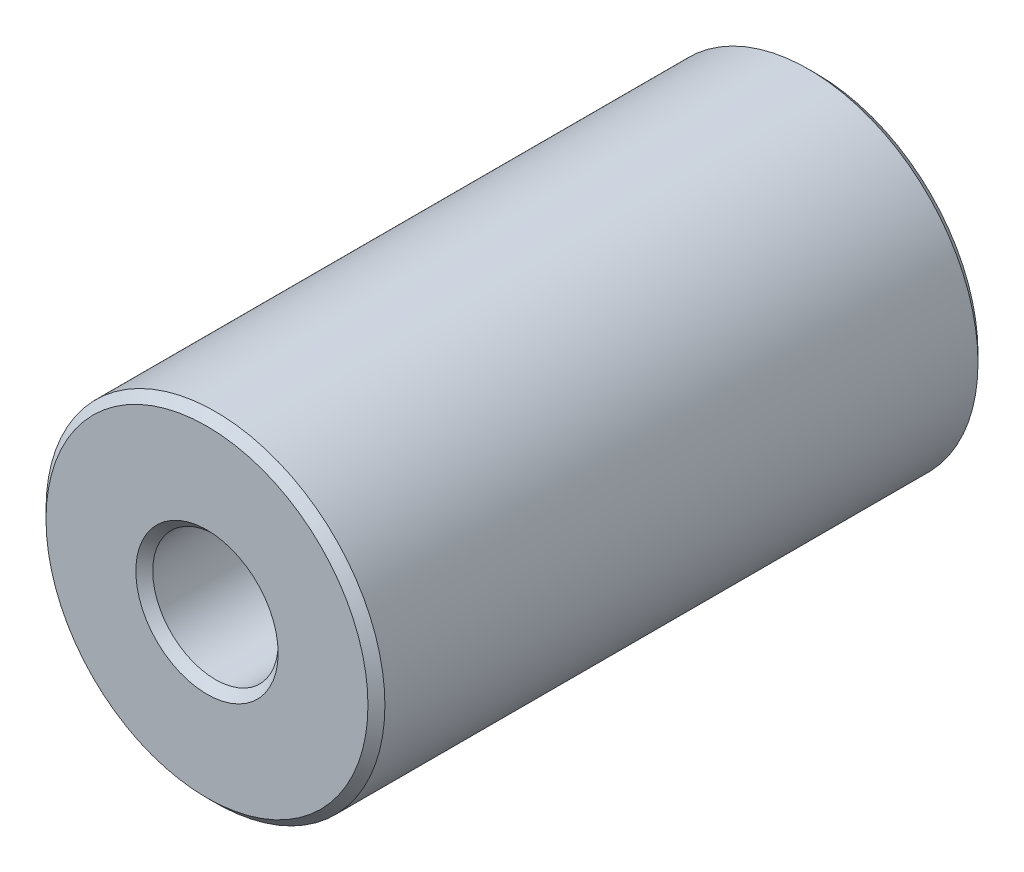
ISO-10303-21;
HEADER;
FILE_DESCRIPTION(('STEP AP214'),'2;1');
FILE_NAME('part.step','',(''),(''),'','','');
FILE_SCHEMA(('AUTOMOTIVE_DESIGN { 1 0 10303 214 1 1 1 1 }'));
ENDSEC;
DATA;
#1=APPLICATION_CONTEXT('core data for automotive mechanical design processes');
#2=APPLICATION_PROTOCOL_DEFINITION('international standard','automotive_design',2000,#1);
#3=PRODUCT_CONTEXT('',#1,'mechanical');
#4=PRODUCT('Part','Part','',(#3));
#5=PRODUCT_RELATED_PRODUCT_CATEGORY('part','',(#4));
#6=PRODUCT_DEFINITION_FORMATION('','',#4);
#7=PRODUCT_DEFINITION_CONTEXT('part definition',#1,'design');
#8=PRODUCT_DEFINITION('design','',#6,#7);
#9=PRODUCT_DEFINITION_SHAPE('','',#8);
#10=(LENGTH_UNIT() NAMED_UNIT(*) SI_UNIT(.MILLI.,.METRE.));
#11=(NAMED_UNIT(*) PLANE_ANGLE_UNIT() SI_UNIT($,.RADIAN.));
#12=(NAMED_UNIT(*) SI_UNIT($,.STERADIAN.) SOLID_ANGLE_UNIT());
#13=UNCERTAINTY_MEASURE_WITH_UNIT(LENGTH_MEASURE(1.E-05),#10,'distance_accuracy_value','');
#14=(GEOMETRIC_REPRESENTATION_CONTEXT(3) GLOBAL_UNCERTAINTY_ASSIGNED_CONTEXT((#13)) GLOBAL_UNIT_ASSIGNED_CONTEXT((#10,
#11,#12)) REPRESENTATION_CONTEXT('',''));
#15=CARTESIAN_POINT('',(0.,0.,0.));
#16=DIRECTION('',(0.,0.,1.));
#17=DIRECTION('',(1.,0.,0.));
#18=AXIS2_PLACEMENT_3D('',#15,#16,#17);
#19=CARTESIAN_POINT('',(0.,0.,9.));
#20=DIRECTION('',(0.,0.,-1.));
#21=DIRECTION('',(-1.,0.,0.));
#22=AXIS2_PLACEMENT_3D('',#19,#20,#21);
#23=CYLINDRICAL_SURFACE('',#22,1.85);
#24=CARTESIAN_POINT('',(0.,0.,-8.75000000002046));
#25=DIRECTION('',(0.,0.,-1.));
#26=DIRECTION('',(-1.,0.,0.));
#27=AXIS2_PLACEMENT_3D('',#24,#25,#26);
#28=CIRCLE('',#27,1.8500000000472);
#29=CARTESIAN_POINT('',(-1.8500000000472,0.,-8.75000000002046));
#30=VERTEX_POINT('',#29);
#31=EDGE_CURVE('E28',#30,#30,#28,.T.);
#32=ORIENTED_EDGE('',*,*,#31,.T.);
#33=EDGE_LOOP('',(#32));
#34=FACE_BOUND('',#33,.T.);
#35=CARTESIAN_POINT('',(0.,0.,8.75000000002046));
#36=DIRECTION('',(0.,0.,1.));
#37=DIRECTION('',(1.,0.,0.));
#38=AXIS2_PLACEMENT_3D('',#35,#36,#37);
#39=CIRCLE('',#38,1.84999999993352);
#40=CARTESIAN_POINT('',(1.84999999993352,0.,8.75000000002046));
#41=VERTEX_POINT('',#40);
#42=EDGE_CURVE('E31',#41,#41,#39,.T.);
#43=ORIENTED_EDGE('',*,*,#42,.T.);
#44=EDGE_LOOP('',(#43));
#45=FACE_BOUND('',#44,.T.);
#46=ADVANCED_FACE('F13',(#34,#45),#23,.F.);
#47=CARTESIAN_POINT('',(0.,0.,8.99999999990087));
#48=DIRECTION('',(0.,0.,1.));
#49=DIRECTION('',(1.,0.,0.));
#50=AXIS2_PLACEMENT_3D('',#47,#48,#49);
#51=CONICAL_SURFACE('',#50,2.09999999987076,0.785398163397448);
#52=ORIENTED_EDGE('',*,*,#42,.F.);
#53=EDGE_LOOP('',(#52));
#54=FACE_BOUND('',#53,.T.);
#55=CARTESIAN_POINT('',(0.,0.,9.00000000001455));
#56=DIRECTION('',(0.,0.,1.));
#57=DIRECTION('',(1.,0.,0.));
#58=AXIS2_PLACEMENT_3D('',#55,#56,#57);
#59=CIRCLE('',#58,2.09999999998445);
#60=CARTESIAN_POINT('',(2.09999999998445,0.,9.00000000001455));
#61=VERTEX_POINT('',#60);
#62=EDGE_CURVE('E16',#61,#61,#59,.F.);
#63=ORIENTED_EDGE('',*,*,#62,.F.);
#64=EDGE_LOOP('',(#63));
#65=FACE_BOUND('',#64,.T.);
#66=ADVANCED_FACE('F48',(#54,#65),#51,.F.);
#67=CARTESIAN_POINT('',(0.,0.,-8.99999999995771));
#68=DIRECTION('',(0.,0.,-1.));
#69=DIRECTION('',(-1.,0.,0.));
#70=AXIS2_PLACEMENT_3D('',#67,#68,#69);
#71=CONICAL_SURFACE('',#70,2.0999999999276,0.785398163283761);
#72=CARTESIAN_POINT('',(0.,0.,-9.00000000001455));
#73=DIRECTION('',(0.,0.,-1.));
#74=DIRECTION('',(-1.,0.,0.));
#75=AXIS2_PLACEMENT_3D('',#72,#73,#74);
#76=CIRCLE('',#75,2.09999999998444);
#77=CARTESIAN_POINT('',(-2.09999999998445,0.,-9.00000000001455));
#78=VERTEX_POINT('',#77);
#79=EDGE_CURVE('E38',#78,#78,#76,.T.);
#80=ORIENTED_EDGE('',*,*,#79,.T.);
#81=EDGE_LOOP('',(#80));
#82=FACE_BOUND('',#81,.T.);
#83=ORIENTED_EDGE('',*,*,#31,.F.);
#84=EDGE_LOOP('',(#83));
#85=FACE_BOUND('',#84,.T.);
#86=ADVANCED_FACE('F50',(#82,#85),#71,.F.);
#87=CARTESIAN_POINT('',(0.,0.,9.));
#88=DIRECTION('',(0.,0.,1.));
#89=DIRECTION('',(1.,0.,0.));
#90=AXIS2_PLACEMENT_3D('',#87,#88,#89);
#91=PLANE('',#90);
#92=ORIENTED_EDGE('',*,*,#62,.T.);
#93=EDGE_LOOP('',(#92));
#94=FACE_BOUND('',#93,.T.);
#95=CARTESIAN_POINT('',(0.,0.,9.00000000001455));
#96=DIRECTION('',(0.,0.,-1.));
#97=DIRECTION('',(-1.,0.,0.));
#98=AXIS2_PLACEMENT_3D('',#95,#96,#97);
#99=CIRCLE('',#98,4.74999999994452);
#100=CARTESIAN_POINT('',(-4.74999999994452,0.,9.00000000001455));
#101=VERTEX_POINT('',#100);
#102=EDGE_CURVE('E36',#101,#101,#99,.T.);
#103=ORIENTED_EDGE('',*,*,#102,.F.);
#104=EDGE_LOOP('',(#103));
#105=FACE_BOUND('',#104,.T.);
#106=ADVANCED_FACE('F45',(#94,#105),#91,.T.);
#107=CARTESIAN_POINT('',(0.,0.,-9.));
#108=DIRECTION('',(0.,0.,1.));
#109=DIRECTION('',(1.,0.,0.));
#110=AXIS2_PLACEMENT_3D('',#107,#108,#109);
#111=PLANE('',#110);
#112=ORIENTED_EDGE('',*,*,#79,.F.);
#113=EDGE_LOOP('',(#112));
#114=FACE_BOUND('',#113,.T.);
#115=CARTESIAN_POINT('',(0.,0.,-9.00000000001455));
#116=DIRECTION('',(0.,0.,1.));
#117=DIRECTION('',(1.,0.,0.));
#118=AXIS2_PLACEMENT_3D('',#115,#116,#117);
#119=CIRCLE('',#118,4.74999999994452);
#120=CARTESIAN_POINT('',(4.74999999994452,0.,-9.00000000001455));
#121=VERTEX_POINT('',#120);
#122=EDGE_CURVE('E25',#121,#121,#119,.T.);
#123=ORIENTED_EDGE('',*,*,#122,.F.);
#124=EDGE_LOOP('',(#123));
#125=FACE_BOUND('',#124,.T.);
#126=ADVANCED_FACE('F74',(#114,#125),#111,.F.);
#127=CARTESIAN_POINT('',(0.,0.,8.75000000002046));
#128=DIRECTION('',(0.,0.,-1.));
#129=DIRECTION('',(-1.,0.,0.));
#130=AXIS2_PLACEMENT_3D('',#127,#128,#129);
#131=CONICAL_SURFACE('',#130,4.99999999993861,0.785398163397448);
#132=ORIENTED_EDGE('',*,*,#102,.T.);
#133=EDGE_LOOP('',(#132));
#134=FACE_BOUND('',#133,.T.);
#135=CARTESIAN_POINT('',(0.,0.,8.75));
#136=DIRECTION('',(0.,0.,-1.));
#137=DIRECTION('',(-1.,0.,0.));
#138=AXIS2_PLACEMENT_3D('',#135,#136,#137);
#139=CIRCLE('',#138,5.);
#140=CARTESIAN_POINT('',(-5.,0.,8.75));
#141=VERTEX_POINT('',#140);
#142=EDGE_CURVE('E20',#141,#141,#139,.T.);
#143=ORIENTED_EDGE('',*,*,#142,.F.);
#144=EDGE_LOOP('',(#143));
#145=FACE_BOUND('',#144,.T.);
#146=ADVANCED_FACE('F68',(#134,#145),#131,.T.);
#147=CARTESIAN_POINT('',(0.,0.,-8.75000000007731));
#148=DIRECTION('',(0.,0.,1.));
#149=DIRECTION('',(1.,0.,0.));
#150=AXIS2_PLACEMENT_3D('',#147,#148,#149);
#151=CONICAL_SURFACE('',#150,4.99999999988177,0.785398163397448);
#152=CARTESIAN_POINT('',(0.,0.,-8.75));
#153=DIRECTION('',(0.,0.,-1.));
#154=DIRECTION('',(-1.,0.,0.));
#155=AXIS2_PLACEMENT_3D('',#152,#153,#154);
#156=CIRCLE('',#155,5.);
#157=CARTESIAN_POINT('',(-5.,0.,-8.75));
#158=VERTEX_POINT('',#157);
#159=EDGE_CURVE('E9',#158,#158,#156,.F.);
#160=ORIENTED_EDGE('',*,*,#159,.F.);
#161=EDGE_LOOP('',(#160));
#162=FACE_BOUND('',#161,.T.);
#163=ORIENTED_EDGE('',*,*,#122,.T.);
#164=EDGE_LOOP('',(#163));
#165=FACE_BOUND('',#164,.T.);
#166=ADVANCED_FACE('F62',(#162,#165),#151,.T.);
#167=CARTESIAN_POINT('',(0.,0.,9.));
#168=DIRECTION('',(0.,0.,-1.));
#169=DIRECTION('',(-1.,0.,0.));
#170=AXIS2_PLACEMENT_3D('',#167,#168,#169);
#171=CYLINDRICAL_SURFACE('',#170,5.);
#172=ORIENTED_EDGE('',*,*,#142,.T.);
#173=EDGE_LOOP('',(#172));
#174=FACE_BOUND('',#173,.T.);
#175=ORIENTED_EDGE('',*,*,#159,.T.);
#176=EDGE_LOOP('',(#175));
#177=FACE_BOUND('',#176,.T.);
#178=ADVANCED_FACE('F60',(#174,#177),#171,.T.);
#179=CLOSED_SHELL('',(#46,#66,#86,#106,#126,#146,#166,#178));
#180=MANIFOLD_SOLID_BREP('B1',#179);
#181=ADVANCED_BREP_SHAPE_REPRESENTATION('',(#18,#180),#14);
#182=SHAPE_DEFINITION_REPRESENTATION(#9,#181);
ENDSEC;
END-ISO-10303-21;
